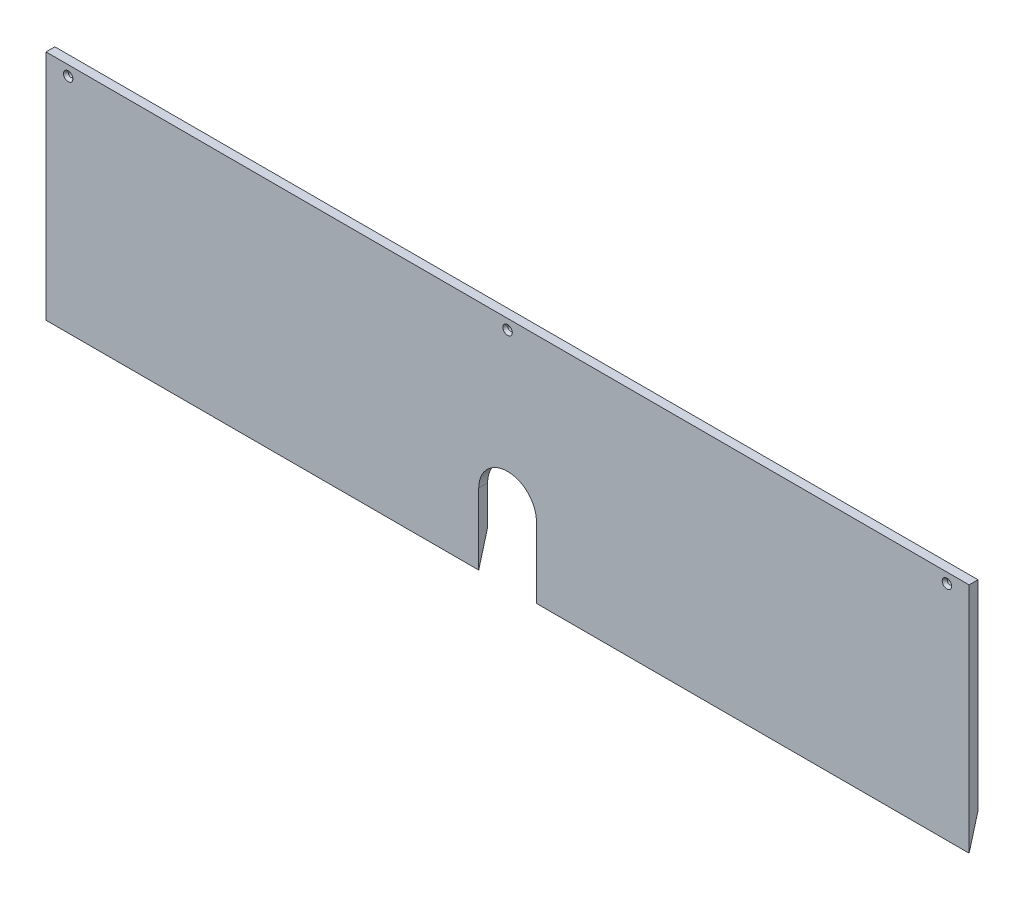
ISO-10303-21;
HEADER;
FILE_DESCRIPTION(('STEP AP214'),'2;1');
FILE_NAME('part.step','',(''),(''),'','','');
FILE_SCHEMA(('AUTOMOTIVE_DESIGN { 1 0 10303 214 1 1 1 1 }'));
ENDSEC;
DATA;
#1=APPLICATION_CONTEXT('core data for automotive mechanical design processes');
#2=APPLICATION_PROTOCOL_DEFINITION('international standard','automotive_design',2000,#1);
#3=PRODUCT_CONTEXT('',#1,'mechanical');
#4=PRODUCT('Part','Part','',(#3));
#5=PRODUCT_RELATED_PRODUCT_CATEGORY('part','',(#4));
#6=PRODUCT_DEFINITION_FORMATION('','',#4);
#7=PRODUCT_DEFINITION_CONTEXT('part definition',#1,'design');
#8=PRODUCT_DEFINITION('design','',#6,#7);
#9=PRODUCT_DEFINITION_SHAPE('','',#8);
#10=(LENGTH_UNIT() NAMED_UNIT(*) SI_UNIT(.MILLI.,.METRE.));
#11=(NAMED_UNIT(*) PLANE_ANGLE_UNIT() SI_UNIT($,.RADIAN.));
#12=(NAMED_UNIT(*) SI_UNIT($,.STERADIAN.) SOLID_ANGLE_UNIT());
#13=UNCERTAINTY_MEASURE_WITH_UNIT(LENGTH_MEASURE(1.E-05),#10,'distance_accuracy_value','');
#14=(GEOMETRIC_REPRESENTATION_CONTEXT(3) GLOBAL_UNCERTAINTY_ASSIGNED_CONTEXT((#13)) GLOBAL_UNIT_ASSIGNED_CONTEXT((#10,
#11,#12)) REPRESENTATION_CONTEXT('',''));
#15=CARTESIAN_POINT('',(0.,0.,0.));
#16=DIRECTION('',(0.,0.,1.));
#17=DIRECTION('',(1.,0.,0.));
#18=AXIS2_PLACEMENT_3D('',#15,#16,#17);
#19=CARTESIAN_POINT('',(-490.446148229026,163.66591889708,0.));
#20=DIRECTION('',(0.,0.,1.));
#21=DIRECTION('',(1.,0.,0.));
#22=AXIS2_PLACEMENT_3D('',#19,#20,#21);
#23=PLANE('',#22);
#24=CARTESIAN_POINT('',(2.197536589984E-13,315.612647404422,1.45716771982052E-13));
#25=DIRECTION('',(0.,0.,1.));
#26=DIRECTION('',(0.,-1.,0.));
#27=AXIS2_PLACEMENT_3D('',#24,#25,#26);
#28=CIRCLE('',#27,3.37819999999983);
#29=CARTESIAN_POINT('',(2.19774510269611E-13,312.234447404422,1.45904299753141E-13));
#30=VERTEX_POINT('',#29);
#31=EDGE_CURVE('E201',#30,#30,#28,.F.);
#32=ORIENTED_EDGE('',*,*,#31,.F.);
#33=EDGE_LOOP('',(#32));
#34=FACE_BOUND('',#33,.T.);
#35=CARTESIAN_POINT('',(-628.534270001134,315.612647404422,1.59594559789866E-13));
#36=DIRECTION('',(0.,0.,1.));
#37=DIRECTION('',(0.,-1.,0.));
#38=AXIS2_PLACEMENT_3D('',#35,#36,#37);
#39=CIRCLE('',#38,3.37819999999983);
#40=CARTESIAN_POINT('',(-628.534270001134,312.234447404422,1.59782087560956E-13));
#41=VERTEX_POINT('',#40);
#42=EDGE_CURVE('E195',#41,#41,#39,.F.);
#43=ORIENTED_EDGE('',*,*,#42,.F.);
#44=EDGE_LOOP('',(#43));
#45=FACE_BOUND('',#44,.T.);
#46=CARTESIAN_POINT('',(628.534270001134,315.612647404422,-3.95516952522712E-13));
#47=DIRECTION('',(0.,0.,1.));
#48=DIRECTION('',(0.,-1.,0.));
#49=AXIS2_PLACEMENT_3D('',#46,#47,#48);
#50=CIRCLE('',#49,3.37820000000005);
#51=CARTESIAN_POINT('',(628.534270001134,312.234447404422,-3.95329424751623E-13));
#52=VERTEX_POINT('',#51);
#53=EDGE_CURVE('E136',#52,#52,#50,.F.);
#54=ORIENTED_EDGE('',*,*,#53,.F.);
#55=EDGE_LOOP('',(#54));
#56=FACE_BOUND('',#55,.T.);
#57=DIRECTION('',(0.,1.,0.));
#58=VECTOR('',#57,1.);
#59=CARTESIAN_POINT('',(-41.275,163.66591889708,0.));
#60=LINE('',#59,#58);
#61=CARTESIAN_POINT('',(-41.275,43.6959761040237,0.));
#62=VERTEX_POINT('',#61);
#63=CARTESIAN_POINT('',(-41.275,99.0316903897379,0.));
#64=VERTEX_POINT('',#63);
#65=EDGE_CURVE('E265',#62,#64,#60,.T.);
#66=ORIENTED_EDGE('',*,*,#65,.F.);
#67=DIRECTION('',(1.,0.,0.));
#68=VECTOR('',#67,1.);
#69=CARTESIAN_POINT('',(-490.446148229026,43.6959761040237,0.));
#70=LINE('',#69,#68);
#71=CARTESIAN_POINT('',(-660.284270001134,43.6959761040237,0.));
#72=VERTEX_POINT('',#71);
#73=EDGE_CURVE('E144',#72,#62,#70,.T.);
#74=ORIENTED_EDGE('',*,*,#73,.F.);
#75=DIRECTION('',(0.,-1.,0.));
#76=VECTOR('',#75,1.);
#77=CARTESIAN_POINT('',(-660.284270001134,163.66591889708,0.));
#78=LINE('',#77,#76);
#79=CARTESIAN_POINT('',(-660.284270001134,329.900147404422,0.));
#80=VERTEX_POINT('',#79);
#81=EDGE_CURVE('E172',#80,#72,#78,.T.);
#82=ORIENTED_EDGE('',*,*,#81,.F.);
#83=DIRECTION('',(1.,0.,0.));
#84=VECTOR('',#83,1.);
#85=CARTESIAN_POINT('',(0.,329.900147404422,0.));
#86=LINE('',#85,#84);
#87=CARTESIAN_POINT('',(660.284270001134,329.900147404422,0.));
#88=VERTEX_POINT('',#87);
#89=EDGE_CURVE('E168',#80,#88,#86,.T.);
#90=ORIENTED_EDGE('',*,*,#89,.T.);
#91=DIRECTION('',(0.,-1.,0.));
#92=VECTOR('',#91,1.);
#93=CARTESIAN_POINT('',(660.284270001134,163.66591889708,0.));
#94=LINE('',#93,#92);
#95=CARTESIAN_POINT('',(660.284270001134,43.6959761040237,0.));
#96=VERTEX_POINT('',#95);
#97=EDGE_CURVE('E177',#88,#96,#94,.T.);
#98=ORIENTED_EDGE('',*,*,#97,.T.);
#99=CARTESIAN_POINT('',(41.275,43.6959761040237,0.));
#100=VERTEX_POINT('',#99);
#101=EDGE_CURVE('E187',#100,#96,#70,.T.);
#102=ORIENTED_EDGE('',*,*,#101,.F.);
#103=DIRECTION('',(0.,1.,0.));
#104=VECTOR('',#103,1.);
#105=CARTESIAN_POINT('',(41.275,163.66591889708,0.));
#106=LINE('',#105,#104);
#107=CARTESIAN_POINT('',(41.275,99.0316903897379,0.));
#108=VERTEX_POINT('',#107);
#109=EDGE_CURVE('E219',#100,#108,#106,.T.);
#110=ORIENTED_EDGE('',*,*,#109,.T.);
#111=CARTESIAN_POINT('',(0.,99.031690389738,-2.27248775352962E-13));
#112=DIRECTION('',(0.,0.,1.));
#113=DIRECTION('',(0.,-1.,0.));
#114=AXIS2_PLACEMENT_3D('',#111,#112,#113);
#115=CIRCLE('',#114,41.275);
#116=EDGE_CURVE('E11',#108,#64,#115,.T.);
#117=ORIENTED_EDGE('',*,*,#116,.T.);
#118=EDGE_LOOP('',(#66,#74,#82,#90,#98,#102,#110,#117));
#119=FACE_BOUND('',#118,.T.);
#120=ADVANCED_FACE('F42',(#34,#45,#56,#119),#23,.F.);
#121=CARTESIAN_POINT('',(-490.446148229026,163.66591889708,12.7));
#122=DIRECTION('',(0.,0.,1.));
#123=DIRECTION('',(1.,0.,0.));
#124=AXIS2_PLACEMENT_3D('',#121,#122,#123);
#125=PLANE('',#124);
#126=CARTESIAN_POINT('',(2.20106154808718E-13,315.612647404422,12.6999999999998));
#127=DIRECTION('',(0.,0.,1.));
#128=DIRECTION('',(0.,-1.,0.));
#129=AXIS2_PLACEMENT_3D('',#126,#127,#128);
#130=CIRCLE('',#129,6.74370000000013);
#131=CARTESIAN_POINT('',(2.20147778962902E-13,308.868947404421,12.6999999999998));
#132=VERTEX_POINT('',#131);
#133=EDGE_CURVE('E355',#132,#132,#130,.T.);
#134=ORIENTED_EDGE('',*,*,#133,.F.);
#135=EDGE_LOOP('',(#134));
#136=FACE_BOUND('',#135,.T.);
#137=CARTESIAN_POINT('',(-628.534270001134,315.612647404422,12.6999999999998));
#138=DIRECTION('',(0.,0.,1.));
#139=DIRECTION('',(0.,-1.,0.));
#140=AXIS2_PLACEMENT_3D('',#137,#138,#139);
#141=CIRCLE('',#140,6.74370000000013);
#142=CARTESIAN_POINT('',(-628.534270001134,308.868947404421,12.6999999999998));
#143=VERTEX_POINT('',#142);
#144=EDGE_CURVE('E205',#143,#143,#141,.T.);
#145=ORIENTED_EDGE('',*,*,#144,.F.);
#146=EDGE_LOOP('',(#145));
#147=FACE_BOUND('',#146,.T.);
#148=CARTESIAN_POINT('',(628.534270001134,315.612647404422,12.7000000000006));
#149=DIRECTION('',(0.,0.,1.));
#150=DIRECTION('',(0.,-1.,0.));
#151=AXIS2_PLACEMENT_3D('',#148,#149,#150);
#152=CIRCLE('',#151,6.7437);
#153=CARTESIAN_POINT('',(628.534270001134,308.868947404422,12.7000000000006));
#154=VERTEX_POINT('',#153);
#155=EDGE_CURVE('E199',#154,#154,#152,.T.);
#156=ORIENTED_EDGE('',*,*,#155,.F.);
#157=EDGE_LOOP('',(#156));
#158=FACE_BOUND('',#157,.T.);
#159=DIRECTION('',(1.,0.,0.));
#160=VECTOR('',#159,1.);
#161=CARTESIAN_POINT('',(0.,-2.56830961026197,12.7000000000001));
#162=LINE('',#161,#160);
#163=CARTESIAN_POINT('',(-660.284270001134,-2.56830961026203,12.7000000000001));
#164=VERTEX_POINT('',#163);
#165=CARTESIAN_POINT('',(-41.275,-2.56830961026197,12.7000000000001));
#166=VERTEX_POINT('',#165);
#167=EDGE_CURVE('E141',#164,#166,#162,.T.);
#168=ORIENTED_EDGE('',*,*,#167,.T.);
#169=DIRECTION('',(0.,1.,0.));
#170=VECTOR('',#169,1.);
#171=CARTESIAN_POINT('',(-41.275,27.1790833719824,12.7));
#172=LINE('',#171,#170);
#173=CARTESIAN_POINT('',(-41.275,99.031690389738,12.7));
#174=VERTEX_POINT('',#173);
#175=EDGE_CURVE('E127',#166,#174,#172,.T.);
#176=ORIENTED_EDGE('',*,*,#175,.T.);
#177=CARTESIAN_POINT('',(0.,99.0316903897381,12.6999999999997));
#178=DIRECTION('',(0.,0.,1.));
#179=DIRECTION('',(0.,-1.,0.));
#180=AXIS2_PLACEMENT_3D('',#177,#178,#179);
#181=CIRCLE('',#180,41.275);
#182=CARTESIAN_POINT('',(41.275,99.0316903897381,12.7));
#183=VERTEX_POINT('',#182);
#184=EDGE_CURVE('E51',#174,#183,#181,.F.);
#185=ORIENTED_EDGE('',*,*,#184,.T.);
#186=DIRECTION('',(0.,1.,0.));
#187=VECTOR('',#186,1.);
#188=CARTESIAN_POINT('',(41.275,27.1790833719824,12.7));
#189=LINE('',#188,#187);
#190=CARTESIAN_POINT('',(41.275,-2.56830961026197,12.7000000000001));
#191=VERTEX_POINT('',#190);
#192=EDGE_CURVE('E135',#191,#183,#189,.T.);
#193=ORIENTED_EDGE('',*,*,#192,.F.);
#194=CARTESIAN_POINT('',(660.284270001134,-2.56830961026202,12.7));
#195=VERTEX_POINT('',#194);
#196=EDGE_CURVE('E156',#191,#195,#162,.T.);
#197=ORIENTED_EDGE('',*,*,#196,.T.);
#198=DIRECTION('',(0.,-1.,0.));
#199=VECTOR('',#198,1.);
#200=CARTESIAN_POINT('',(660.284270001134,163.66591889708,12.6999999999999));
#201=LINE('',#200,#199);
#202=CARTESIAN_POINT('',(660.284270001134,329.900147404422,12.7));
#203=VERTEX_POINT('',#202);
#204=EDGE_CURVE('E155',#203,#195,#201,.T.);
#205=ORIENTED_EDGE('',*,*,#204,.F.);
#206=DIRECTION('',(1.,0.,0.));
#207=VECTOR('',#206,1.);
#208=CARTESIAN_POINT('',(0.,329.900147404422,12.7));
#209=LINE('',#208,#207);
#210=CARTESIAN_POINT('',(-660.284270001134,329.900147404422,12.7));
#211=VERTEX_POINT('',#210);
#212=EDGE_CURVE('E181',#211,#203,#209,.T.);
#213=ORIENTED_EDGE('',*,*,#212,.F.);
#214=DIRECTION('',(0.,-1.,0.));
#215=VECTOR('',#214,1.);
#216=CARTESIAN_POINT('',(-660.284270001134,163.66591889708,12.7));
#217=LINE('',#216,#215);
#218=EDGE_CURVE('E153',#211,#164,#217,.T.);
#219=ORIENTED_EDGE('',*,*,#218,.T.);
#220=EDGE_LOOP('',(#168,#176,#185,#193,#197,#205,#213,#219));
#221=FACE_BOUND('',#220,.T.);
#222=ADVANCED_FACE('F150',(#136,#147,#158,#221),#125,.T.);
#223=CARTESIAN_POINT('',(2.12949277293204E-13,658.766562631298,-168.842906105526));
#224=DIRECTION('',(0.,-0.26471698178117,-0.964326147917118));
#225=DIRECTION('',(1.,0.,0.));
#226=AXIS2_PLACEMENT_3D('',#223,#224,#225);
#227=PLANE('',#226);
#228=ORIENTED_EDGE('',*,*,#73,.T.);
#229=DIRECTION('',(0.,-0.964326147917118,0.26471698178117));
#230=VECTOR('',#229,1.);
#231=CARTESIAN_POINT('',(-41.275,658.766562631298,-168.842906105526));
#232=LINE('',#231,#230);
#233=EDGE_CURVE('E130',#62,#166,#232,.T.);
#234=ORIENTED_EDGE('',*,*,#233,.T.);
#235=ORIENTED_EDGE('',*,*,#167,.F.);
#236=DIRECTION('',(0.,0.964326147917118,-0.26471698178117));
#237=VECTOR('',#236,1.);
#238=CARTESIAN_POINT('',(-660.284270001134,152.017041961993,-29.7351945492464));
#239=LINE('',#238,#237);
#240=EDGE_CURVE('E173',#164,#72,#239,.T.);
#241=ORIENTED_EDGE('',*,*,#240,.T.);
#242=EDGE_LOOP('',(#228,#234,#235,#241));
#243=FACE_BOUND('',#242,.T.);
#244=ADVANCED_FACE('F140',(#243),#227,.T.);
#245=CARTESIAN_POINT('',(-660.284270001134,163.66591889708,12.7));
#246=DIRECTION('',(1.,0.,0.));
#247=DIRECTION('',(0.,-0.26471698178117,-0.964326147917118));
#248=AXIS2_PLACEMENT_3D('',#245,#246,#247);
#249=PLANE('',#248);
#250=ORIENTED_EDGE('',*,*,#240,.F.);
#251=ORIENTED_EDGE('',*,*,#218,.F.);
#252=DIRECTION('',(0.,0.,-1.));
#253=VECTOR('',#252,1.);
#254=CARTESIAN_POINT('',(-660.284270001134,329.900147404422,12.7));
#255=LINE('',#254,#253);
#256=EDGE_CURVE('E184',#211,#80,#255,.T.);
#257=ORIENTED_EDGE('',*,*,#256,.T.);
#258=ORIENTED_EDGE('',*,*,#81,.T.);
#259=EDGE_LOOP('',(#250,#251,#257,#258));
#260=FACE_BOUND('',#259,.T.);
#261=ADVANCED_FACE('F245',(#260),#249,.F.);
#262=CARTESIAN_POINT('',(660.284270001134,163.66591889708,12.6999999999999));
#263=DIRECTION('',(1.,0.,0.));
#264=DIRECTION('',(0.,-0.26471698178117,-0.964326147917118));
#265=AXIS2_PLACEMENT_3D('',#262,#263,#264);
#266=PLANE('',#265);
#267=ORIENTED_EDGE('',*,*,#204,.T.);
#268=DIRECTION('',(0.,0.964326147917118,-0.26471698178117));
#269=VECTOR('',#268,1.);
#270=CARTESIAN_POINT('',(660.284270001134,152.017041961993,-29.7351945492464));
#271=LINE('',#270,#269);
#272=EDGE_CURVE('E263',#195,#96,#271,.T.);
#273=ORIENTED_EDGE('',*,*,#272,.T.);
#274=ORIENTED_EDGE('',*,*,#97,.F.);
#275=DIRECTION('',(0.,0.,-1.));
#276=VECTOR('',#275,1.);
#277=CARTESIAN_POINT('',(660.284270001134,329.900147404422,12.7));
#278=LINE('',#277,#276);
#279=EDGE_CURVE('E163',#203,#88,#278,.T.);
#280=ORIENTED_EDGE('',*,*,#279,.F.);
#281=EDGE_LOOP('',(#267,#273,#274,#280));
#282=FACE_BOUND('',#281,.T.);
#283=ADVANCED_FACE('F241',(#282),#266,.T.);
#284=CARTESIAN_POINT('',(0.,329.900147404422,12.7));
#285=DIRECTION('',(0.,1.,0.));
#286=DIRECTION('',(0.,0.,1.));
#287=AXIS2_PLACEMENT_3D('',#284,#285,#286);
#288=PLANE('',#287);
#289=ORIENTED_EDGE('',*,*,#89,.F.);
#290=ORIENTED_EDGE('',*,*,#256,.F.);
#291=ORIENTED_EDGE('',*,*,#212,.T.);
#292=ORIENTED_EDGE('',*,*,#279,.T.);
#293=EDGE_LOOP('',(#289,#290,#291,#292));
#294=FACE_BOUND('',#293,.T.);
#295=ADVANCED_FACE('F244',(#294),#288,.T.);
#296=DIRECTION('',(0.,-0.964326147917118,0.26471698178117));
#297=VECTOR('',#296,1.);
#298=CARTESIAN_POINT('',(41.275,658.766562631298,-168.842906105526));
#299=LINE('',#298,#297);
#300=EDGE_CURVE('E147',#100,#191,#299,.T.);
#301=ORIENTED_EDGE('',*,*,#300,.F.);
#302=ORIENTED_EDGE('',*,*,#101,.T.);
#303=ORIENTED_EDGE('',*,*,#272,.F.);
#304=ORIENTED_EDGE('',*,*,#196,.F.);
#305=EDGE_LOOP('',(#301,#302,#303,#304));
#306=FACE_BOUND('',#305,.T.);
#307=ADVANCED_FACE('F250',(#306),#227,.T.);
#308=CARTESIAN_POINT('',(-41.2750000000001,27.179083371981,-3552.23415908109));
#309=DIRECTION('',(1.,0.,0.));
#310=DIRECTION('',(0.,0.964326147917118,-0.26471698178117));
#311=AXIS2_PLACEMENT_3D('',#308,#309,#310);
#312=PLANE('',#311);
#313=ORIENTED_EDGE('',*,*,#65,.T.);
#314=DIRECTION('',(0.,0.,1.));
#315=VECTOR('',#314,1.);
#316=CARTESIAN_POINT('',(-41.2750000000001,99.0316903897353,-3552.23415908109));
#317=LINE('',#316,#315);
#318=EDGE_CURVE('E131',#64,#174,#317,.T.);
#319=ORIENTED_EDGE('',*,*,#318,.T.);
#320=ORIENTED_EDGE('',*,*,#175,.F.);
#321=ORIENTED_EDGE('',*,*,#233,.F.);
#322=EDGE_LOOP('',(#313,#319,#320,#321));
#323=FACE_BOUND('',#322,.T.);
#324=ADVANCED_FACE('F129',(#323),#312,.T.);
#325=CARTESIAN_POINT('',(41.2749999999999,27.179083371981,-3552.23415908109));
#326=DIRECTION('',(1.,0.,0.));
#327=DIRECTION('',(0.,0.964326147917118,-0.26471698178117));
#328=AXIS2_PLACEMENT_3D('',#325,#326,#327);
#329=PLANE('',#328);
#330=ORIENTED_EDGE('',*,*,#192,.T.);
#331=DIRECTION('',(0.,0.,1.));
#332=VECTOR('',#331,1.);
#333=CARTESIAN_POINT('',(41.275,99.0316903897379,1.64798730217797E-12));
#334=LINE('',#333,#332);
#335=EDGE_CURVE('E146',#183,#108,#334,.F.);
#336=ORIENTED_EDGE('',*,*,#335,.T.);
#337=ORIENTED_EDGE('',*,*,#109,.F.);
#338=ORIENTED_EDGE('',*,*,#300,.T.);
#339=EDGE_LOOP('',(#330,#336,#337,#338));
#340=FACE_BOUND('',#339,.T.);
#341=ADVANCED_FACE('F216',(#340),#329,.F.);
#342=CARTESIAN_POINT('',(628.534270001134,315.612647404419,-3553.21699062703));
#343=DIRECTION('',(0.,0.,1.));
#344=DIRECTION('',(0.,-1.,0.));
#345=AXIS2_PLACEMENT_3D('',#342,#343,#344);
#346=CYLINDRICAL_SURFACE('',#345,3.37820000000005);
#347=CARTESIAN_POINT('',(628.534270001134,315.612647404422,8.82843512549793));
#348=DIRECTION('',(0.,0.,1.));
#349=DIRECTION('',(0.,-1.,0.));
#350=AXIS2_PLACEMENT_3D('',#347,#348,#349);
#351=CIRCLE('',#350,3.37820000000011);
#352=CARTESIAN_POINT('',(628.534270001134,312.234447404422,8.82843512549793));
#353=VERTEX_POINT('',#352);
#354=EDGE_CURVE('E194',#353,#353,#351,.T.);
#355=ORIENTED_EDGE('',*,*,#354,.T.);
#356=EDGE_LOOP('',(#355));
#357=FACE_BOUND('',#356,.T.);
#358=ORIENTED_EDGE('',*,*,#53,.T.);
#359=EDGE_LOOP('',(#358));
#360=FACE_BOUND('',#359,.T.);
#361=ADVANCED_FACE('F313',(#357,#360),#346,.F.);
#362=CARTESIAN_POINT('',(628.534270001134,315.612647404422,8.82843512549793));
#363=DIRECTION('',(0.,0.,1.));
#364=DIRECTION('',(0.,-1.,0.));
#365=AXIS2_PLACEMENT_3D('',#362,#363,#364);
#366=CONICAL_SURFACE('',#365,3.3782,0.715584993317632);
#367=ORIENTED_EDGE('',*,*,#155,.T.);
#368=EDGE_LOOP('',(#367));
#369=FACE_BOUND('',#368,.T.);
#370=ORIENTED_EDGE('',*,*,#354,.F.);
#371=EDGE_LOOP('',(#370));
#372=FACE_BOUND('',#371,.T.);
#373=ADVANCED_FACE('F309',(#369,#372),#366,.F.);
#374=CARTESIAN_POINT('',(-628.534270001134,315.612647404419,-3553.21699062703));
#375=DIRECTION('',(0.,0.,1.));
#376=DIRECTION('',(0.,-1.,0.));
#377=AXIS2_PLACEMENT_3D('',#374,#375,#376);
#378=CYLINDRICAL_SURFACE('',#377,3.37819999999983);
#379=CARTESIAN_POINT('',(-628.534270001134,315.612647404422,8.82843512549709));
#380=DIRECTION('',(0.,0.,1.));
#381=DIRECTION('',(0.,-1.,0.));
#382=AXIS2_PLACEMENT_3D('',#379,#380,#381);
#383=CIRCLE('',#382,3.37820000000011);
#384=CARTESIAN_POINT('',(-628.534270001134,312.234447404422,8.82843512549709));
#385=VERTEX_POINT('',#384);
#386=EDGE_CURVE('E200',#385,#385,#383,.T.);
#387=ORIENTED_EDGE('',*,*,#386,.T.);
#388=EDGE_LOOP('',(#387));
#389=FACE_BOUND('',#388,.T.);
#390=ORIENTED_EDGE('',*,*,#42,.T.);
#391=EDGE_LOOP('',(#390));
#392=FACE_BOUND('',#391,.T.);
#393=ADVANCED_FACE('F312',(#389,#392),#378,.F.);
#394=CARTESIAN_POINT('',(-628.534270001134,315.612647404422,8.82843512549709));
#395=DIRECTION('',(0.,0.,1.));
#396=DIRECTION('',(0.,-1.,0.));
#397=AXIS2_PLACEMENT_3D('',#394,#395,#396);
#398=CONICAL_SURFACE('',#397,3.37820000000004,0.715584993317651);
#399=ORIENTED_EDGE('',*,*,#144,.T.);
#400=EDGE_LOOP('',(#399));
#401=FACE_BOUND('',#400,.T.);
#402=ORIENTED_EDGE('',*,*,#386,.F.);
#403=EDGE_LOOP('',(#402));
#404=FACE_BOUND('',#403,.T.);
#405=ADVANCED_FACE('F337',(#401,#404),#398,.F.);
#406=CARTESIAN_POINT('',(1.21132076136314E-13,315.612647404419,-3553.21699062703));
#407=DIRECTION('',(0.,0.,1.));
#408=DIRECTION('',(0.,-1.,0.));
#409=AXIS2_PLACEMENT_3D('',#406,#407,#408);
#410=CYLINDRICAL_SURFACE('',#409,3.37819999999983);
#411=CARTESIAN_POINT('',(2.19998697297093E-13,315.612647404422,8.82843512549707));
#412=DIRECTION('',(0.,0.,1.));
#413=DIRECTION('',(0.,-1.,0.));
#414=AXIS2_PLACEMENT_3D('',#411,#412,#413);
#415=CIRCLE('',#414,3.37820000000011);
#416=CARTESIAN_POINT('',(2.20019548568304E-13,312.234447404422,8.82843512549707));
#417=VERTEX_POINT('',#416);
#418=EDGE_CURVE('E206',#417,#417,#415,.T.);
#419=ORIENTED_EDGE('',*,*,#418,.T.);
#420=EDGE_LOOP('',(#419));
#421=FACE_BOUND('',#420,.T.);
#422=ORIENTED_EDGE('',*,*,#31,.T.);
#423=EDGE_LOOP('',(#422));
#424=FACE_BOUND('',#423,.T.);
#425=ADVANCED_FACE('F226',(#421,#424),#410,.F.);
#426=CARTESIAN_POINT('',(2.19998697297093E-13,315.612647404422,8.82843512549707));
#427=DIRECTION('',(0.,0.,1.));
#428=DIRECTION('',(0.,-1.,0.));
#429=AXIS2_PLACEMENT_3D('',#426,#427,#428);
#430=CONICAL_SURFACE('',#429,3.37820000000004,0.715584993317651);
#431=ORIENTED_EDGE('',*,*,#133,.T.);
#432=EDGE_LOOP('',(#431));
#433=FACE_BOUND('',#432,.T.);
#434=ORIENTED_EDGE('',*,*,#418,.F.);
#435=EDGE_LOOP('',(#434));
#436=FACE_BOUND('',#435,.T.);
#437=ADVANCED_FACE('F222',(#433,#436),#430,.F.);
#438=CARTESIAN_POINT('',(0.,99.0316903897373,-3552.23415908109));
#439=DIRECTION('',(0.,0.,1.));
#440=DIRECTION('',(0.,-1.,0.));
#441=AXIS2_PLACEMENT_3D('',#438,#439,#440);
#442=CYLINDRICAL_SURFACE('',#441,41.275);
#443=ORIENTED_EDGE('',*,*,#318,.F.);
#444=ORIENTED_EDGE('',*,*,#116,.F.);
#445=ORIENTED_EDGE('',*,*,#335,.F.);
#446=ORIENTED_EDGE('',*,*,#184,.F.);
#447=EDGE_LOOP('',(#443,#444,#445,#446));
#448=FACE_BOUND('',#447,.T.);
#449=ADVANCED_FACE('F44',(#448),#442,.F.);
#450=CLOSED_SHELL('',(#120,#222,#244,#261,#283,#295,#307,#324,#341,#361,#373,#393,#405,#425,
#437,#449));
#451=MANIFOLD_SOLID_BREP('B2',#450);
#452=ADVANCED_BREP_SHAPE_REPRESENTATION('',(#18,#451),#14);
#453=SHAPE_DEFINITION_REPRESENTATION(#9,#452);
ENDSEC;
END-ISO-10303-21;
